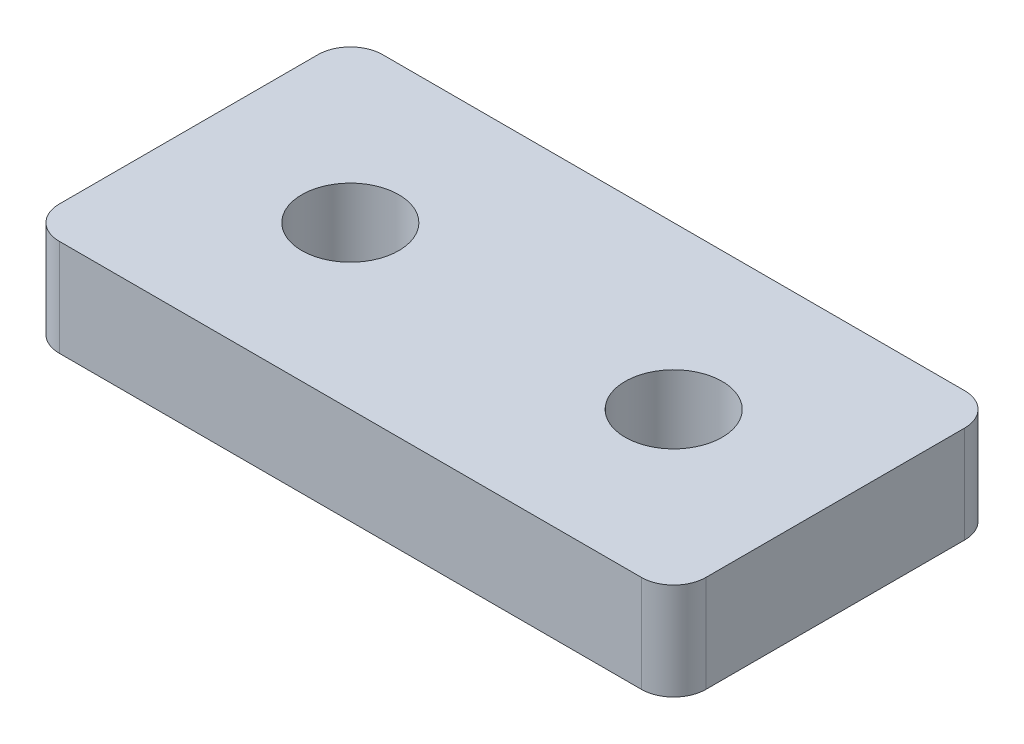
ISO-10303-21;
HEADER;
FILE_DESCRIPTION(('STEP AP214'),'2;1');
FILE_NAME('part.step','',(''),(''),'','','');
FILE_SCHEMA(('AUTOMOTIVE_DESIGN { 1 0 10303 214 1 1 1 1 }'));
ENDSEC;
DATA;
#1=APPLICATION_CONTEXT('core data for automotive mechanical design processes');
#2=APPLICATION_PROTOCOL_DEFINITION('international standard','automotive_design',2000,#1);
#3=PRODUCT_CONTEXT('',#1,'mechanical');
#4=PRODUCT('Part','Part','',(#3));
#5=PRODUCT_RELATED_PRODUCT_CATEGORY('part','',(#4));
#6=PRODUCT_DEFINITION_FORMATION('','',#4);
#7=PRODUCT_DEFINITION_CONTEXT('part definition',#1,'design');
#8=PRODUCT_DEFINITION('design','',#6,#7);
#9=PRODUCT_DEFINITION_SHAPE('','',#8);
#10=(LENGTH_UNIT() NAMED_UNIT(*) SI_UNIT(.MILLI.,.METRE.));
#11=(NAMED_UNIT(*) PLANE_ANGLE_UNIT() SI_UNIT($,.RADIAN.));
#12=(NAMED_UNIT(*) SI_UNIT($,.STERADIAN.) SOLID_ANGLE_UNIT());
#13=UNCERTAINTY_MEASURE_WITH_UNIT(LENGTH_MEASURE(1.E-05),#10,'distance_accuracy_value','');
#14=(GEOMETRIC_REPRESENTATION_CONTEXT(3) GLOBAL_UNCERTAINTY_ASSIGNED_CONTEXT((#13)) GLOBAL_UNIT_ASSIGNED_CONTEXT((#10,
#11,#12)) REPRESENTATION_CONTEXT('',''));
#15=CARTESIAN_POINT('',(0.,0.,0.));
#16=DIRECTION('',(0.,0.,1.));
#17=DIRECTION('',(1.,0.,0.));
#18=AXIS2_PLACEMENT_3D('',#15,#16,#17);
#19=CARTESIAN_POINT('',(0.,3.,0.));
#20=DIRECTION('',(0.,-1.,0.));
#21=DIRECTION('',(0.,0.,-1.));
#22=AXIS2_PLACEMENT_3D('',#19,#20,#21);
#23=PLANE('',#22);
#24=DIRECTION('',(-1.,0.,0.));
#25=VECTOR('',#24,1.);
#26=CARTESIAN_POINT('',(0.,3.,-10.));
#27=LINE('',#26,#25);
#28=CARTESIAN_POINT('',(19.,3.,-10.));
#29=VERTEX_POINT('',#28);
#30=CARTESIAN_POINT('',(1.,3.,-10.));
#31=VERTEX_POINT('',#30);
#32=EDGE_CURVE('E140',#29,#31,#27,.T.);
#33=ORIENTED_EDGE('',*,*,#32,.T.);
#34=CARTESIAN_POINT('',(1.,3.,-9.));
#35=DIRECTION('',(0.,-1.,0.));
#36=DIRECTION('',(0.,0.,-1.));
#37=AXIS2_PLACEMENT_3D('',#34,#35,#36);
#38=CIRCLE('',#37,1.);
#39=CARTESIAN_POINT('',(0.,3.,-9.));
#40=VERTEX_POINT('',#39);
#41=EDGE_CURVE('E159',#31,#40,#38,.F.);
#42=ORIENTED_EDGE('',*,*,#41,.T.);
#43=DIRECTION('',(0.,0.,1.));
#44=VECTOR('',#43,1.);
#45=CARTESIAN_POINT('',(0.,3.,0.));
#46=LINE('',#45,#44);
#47=CARTESIAN_POINT('',(0.,3.,-1.));
#48=VERTEX_POINT('',#47);
#49=EDGE_CURVE('E123',#40,#48,#46,.T.);
#50=ORIENTED_EDGE('',*,*,#49,.T.);
#51=CARTESIAN_POINT('',(1.,3.,-1.));
#52=DIRECTION('',(0.,-1.,0.));
#53=DIRECTION('',(0.,0.,-1.));
#54=AXIS2_PLACEMENT_3D('',#51,#52,#53);
#55=CIRCLE('',#54,1.);
#56=CARTESIAN_POINT('',(1.,3.,0.));
#57=VERTEX_POINT('',#56);
#58=EDGE_CURVE('E157',#48,#57,#55,.F.);
#59=ORIENTED_EDGE('',*,*,#58,.T.);
#60=DIRECTION('',(1.,0.,0.));
#61=VECTOR('',#60,1.);
#62=CARTESIAN_POINT('',(0.,3.,0.));
#63=LINE('',#62,#61);
#64=CARTESIAN_POINT('',(19.,3.,0.));
#65=VERTEX_POINT('',#64);
#66=EDGE_CURVE('E179',#57,#65,#63,.T.);
#67=ORIENTED_EDGE('',*,*,#66,.T.);
#68=CARTESIAN_POINT('',(19.,3.,-1.));
#69=DIRECTION('',(0.,-1.,0.));
#70=DIRECTION('',(0.,0.,-1.));
#71=AXIS2_PLACEMENT_3D('',#68,#69,#70);
#72=CIRCLE('',#71,1.);
#73=CARTESIAN_POINT('',(20.,3.,-1.));
#74=VERTEX_POINT('',#73);
#75=EDGE_CURVE('E58',#65,#74,#72,.F.);
#76=ORIENTED_EDGE('',*,*,#75,.T.);
#77=DIRECTION('',(0.,0.,-1.));
#78=VECTOR('',#77,1.);
#79=CARTESIAN_POINT('',(20.,3.,0.));
#80=LINE('',#79,#78);
#81=CARTESIAN_POINT('',(20.,3.,-9.));
#82=VERTEX_POINT('',#81);
#83=EDGE_CURVE('E169',#74,#82,#80,.T.);
#84=ORIENTED_EDGE('',*,*,#83,.T.);
#85=CARTESIAN_POINT('',(19.,3.,-9.));
#86=DIRECTION('',(0.,-1.,0.));
#87=DIRECTION('',(0.,0.,-1.));
#88=AXIS2_PLACEMENT_3D('',#85,#86,#87);
#89=CIRCLE('',#88,1.);
#90=EDGE_CURVE('E155',#82,#29,#89,.F.);
#91=ORIENTED_EDGE('',*,*,#90,.T.);
#92=EDGE_LOOP('',(#33,#42,#50,#59,#67,#76,#84,#91));
#93=FACE_BOUND('',#92,.T.);
#94=CARTESIAN_POINT('',(5.,3.,-5.));
#95=DIRECTION('',(0.,1.,0.));
#96=DIRECTION('',(0.,0.,1.));
#97=AXIS2_PLACEMENT_3D('',#94,#95,#96);
#98=CIRCLE('',#97,1.5);
#99=CARTESIAN_POINT('',(5.,3.,-3.5));
#100=VERTEX_POINT('',#99);
#101=EDGE_CURVE('E131',#100,#100,#98,.T.);
#102=ORIENTED_EDGE('',*,*,#101,.F.);
#103=EDGE_LOOP('',(#102));
#104=FACE_BOUND('',#103,.T.);
#105=CARTESIAN_POINT('',(15.,3.,-5.));
#106=DIRECTION('',(0.,1.,0.));
#107=DIRECTION('',(0.,0.,1.));
#108=AXIS2_PLACEMENT_3D('',#105,#106,#107);
#109=CIRCLE('',#108,1.5);
#110=CARTESIAN_POINT('',(15.,3.,-3.5));
#111=VERTEX_POINT('',#110);
#112=EDGE_CURVE('E184',#111,#111,#109,.T.);
#113=ORIENTED_EDGE('',*,*,#112,.F.);
#114=EDGE_LOOP('',(#113));
#115=FACE_BOUND('',#114,.T.);
#116=ADVANCED_FACE('F38',(#93,#104,#115),#23,.F.);
#117=CARTESIAN_POINT('',(0.,0.,0.));
#118=DIRECTION('',(0.,-1.,0.));
#119=DIRECTION('',(0.,0.,-1.));
#120=AXIS2_PLACEMENT_3D('',#117,#118,#119);
#121=PLANE('',#120);
#122=CARTESIAN_POINT('',(5.,0.,-5.));
#123=DIRECTION('',(0.,1.,0.));
#124=DIRECTION('',(0.,0.,1.));
#125=AXIS2_PLACEMENT_3D('',#122,#123,#124);
#126=CIRCLE('',#125,1.5);
#127=CARTESIAN_POINT('',(5.,0.,-3.5));
#128=VERTEX_POINT('',#127);
#129=EDGE_CURVE('E137',#128,#128,#126,.T.);
#130=ORIENTED_EDGE('',*,*,#129,.T.);
#131=EDGE_LOOP('',(#130));
#132=FACE_BOUND('',#131,.T.);
#133=DIRECTION('',(0.,0.,1.));
#134=VECTOR('',#133,1.);
#135=CARTESIAN_POINT('',(0.,0.,0.));
#136=LINE('',#135,#134);
#137=CARTESIAN_POINT('',(0.,0.,-9.));
#138=VERTEX_POINT('',#137);
#139=CARTESIAN_POINT('',(0.,0.,-1.));
#140=VERTEX_POINT('',#139);
#141=EDGE_CURVE('E120',#138,#140,#136,.T.);
#142=ORIENTED_EDGE('',*,*,#141,.F.);
#143=CARTESIAN_POINT('',(1.,0.,-9.));
#144=DIRECTION('',(0.,-1.,0.));
#145=DIRECTION('',(0.,0.,-1.));
#146=AXIS2_PLACEMENT_3D('',#143,#144,#145);
#147=CIRCLE('',#146,1.);
#148=CARTESIAN_POINT('',(1.,0.,-10.));
#149=VERTEX_POINT('',#148);
#150=EDGE_CURVE('E103',#138,#149,#147,.T.);
#151=ORIENTED_EDGE('',*,*,#150,.T.);
#152=DIRECTION('',(-1.,0.,0.));
#153=VECTOR('',#152,1.);
#154=CARTESIAN_POINT('',(0.,0.,-10.));
#155=LINE('',#154,#153);
#156=CARTESIAN_POINT('',(19.,0.,-10.));
#157=VERTEX_POINT('',#156);
#158=EDGE_CURVE('E144',#157,#149,#155,.T.);
#159=ORIENTED_EDGE('',*,*,#158,.F.);
#160=CARTESIAN_POINT('',(19.,0.,-9.));
#161=DIRECTION('',(0.,-1.,0.));
#162=DIRECTION('',(0.,0.,-1.));
#163=AXIS2_PLACEMENT_3D('',#160,#161,#162);
#164=CIRCLE('',#163,1.);
#165=CARTESIAN_POINT('',(20.,0.,-9.));
#166=VERTEX_POINT('',#165);
#167=EDGE_CURVE('E148',#157,#166,#164,.T.);
#168=ORIENTED_EDGE('',*,*,#167,.T.);
#169=DIRECTION('',(0.,0.,-1.));
#170=VECTOR('',#169,1.);
#171=CARTESIAN_POINT('',(20.,0.,0.));
#172=LINE('',#171,#170);
#173=CARTESIAN_POINT('',(20.,0.,-1.));
#174=VERTEX_POINT('',#173);
#175=EDGE_CURVE('E134',#174,#166,#172,.T.);
#176=ORIENTED_EDGE('',*,*,#175,.F.);
#177=CARTESIAN_POINT('',(19.,0.,-1.));
#178=DIRECTION('',(0.,-1.,0.));
#179=DIRECTION('',(0.,0.,-1.));
#180=AXIS2_PLACEMENT_3D('',#177,#178,#179);
#181=CIRCLE('',#180,1.);
#182=CARTESIAN_POINT('',(19.,0.,0.));
#183=VERTEX_POINT('',#182);
#184=EDGE_CURVE('E124',#174,#183,#181,.T.);
#185=ORIENTED_EDGE('',*,*,#184,.T.);
#186=DIRECTION('',(1.,0.,0.));
#187=VECTOR('',#186,1.);
#188=CARTESIAN_POINT('',(0.,0.,0.));
#189=LINE('',#188,#187);
#190=CARTESIAN_POINT('',(1.,0.,0.));
#191=VERTEX_POINT('',#190);
#192=EDGE_CURVE('E130',#191,#183,#189,.T.);
#193=ORIENTED_EDGE('',*,*,#192,.F.);
#194=CARTESIAN_POINT('',(1.,0.,-1.));
#195=DIRECTION('',(0.,-1.,0.));
#196=DIRECTION('',(0.,0.,-1.));
#197=AXIS2_PLACEMENT_3D('',#194,#195,#196);
#198=CIRCLE('',#197,1.);
#199=EDGE_CURVE('E114',#191,#140,#198,.T.);
#200=ORIENTED_EDGE('',*,*,#199,.T.);
#201=EDGE_LOOP('',(#142,#151,#159,#168,#176,#185,#193,#200));
#202=FACE_BOUND('',#201,.T.);
#203=CARTESIAN_POINT('',(15.,0.,-5.));
#204=DIRECTION('',(0.,1.,0.));
#205=DIRECTION('',(0.,0.,1.));
#206=AXIS2_PLACEMENT_3D('',#203,#204,#205);
#207=CIRCLE('',#206,1.5);
#208=CARTESIAN_POINT('',(15.,0.,-3.5));
#209=VERTEX_POINT('',#208);
#210=EDGE_CURVE('E186',#209,#209,#207,.T.);
#211=ORIENTED_EDGE('',*,*,#210,.T.);
#212=EDGE_LOOP('',(#211));
#213=FACE_BOUND('',#212,.T.);
#214=ADVANCED_FACE('F127',(#132,#202,#213),#121,.T.);
#215=CARTESIAN_POINT('',(0.,3.,0.));
#216=DIRECTION('',(1.,0.,0.));
#217=DIRECTION('',(0.,0.,-1.));
#218=AXIS2_PLACEMENT_3D('',#215,#216,#217);
#219=PLANE('',#218);
#220=ORIENTED_EDGE('',*,*,#49,.F.);
#221=DIRECTION('',(0.,-1.,0.));
#222=VECTOR('',#221,1.);
#223=CARTESIAN_POINT('',(0.,3.,-9.));
#224=LINE('',#223,#222);
#225=EDGE_CURVE('E107',#40,#138,#224,.T.);
#226=ORIENTED_EDGE('',*,*,#225,.T.);
#227=ORIENTED_EDGE('',*,*,#141,.T.);
#228=DIRECTION('',(0.,-1.,0.));
#229=VECTOR('',#228,1.);
#230=CARTESIAN_POINT('',(0.,3.,-1.));
#231=LINE('',#230,#229);
#232=EDGE_CURVE('E125',#140,#48,#231,.F.);
#233=ORIENTED_EDGE('',*,*,#232,.T.);
#234=EDGE_LOOP('',(#220,#226,#227,#233));
#235=FACE_BOUND('',#234,.T.);
#236=ADVANCED_FACE('F119',(#235),#219,.F.);
#237=CARTESIAN_POINT('',(0.,3.,0.));
#238=DIRECTION('',(0.,0.,-1.));
#239=DIRECTION('',(-1.,0.,0.));
#240=AXIS2_PLACEMENT_3D('',#237,#238,#239);
#241=PLANE('',#240);
#242=ORIENTED_EDGE('',*,*,#66,.F.);
#243=DIRECTION('',(0.,-1.,0.));
#244=VECTOR('',#243,1.);
#245=CARTESIAN_POINT('',(1.,3.,0.));
#246=LINE('',#245,#244);
#247=EDGE_CURVE('E163',#57,#191,#246,.T.);
#248=ORIENTED_EDGE('',*,*,#247,.T.);
#249=ORIENTED_EDGE('',*,*,#192,.T.);
#250=DIRECTION('',(0.,-1.,0.));
#251=VECTOR('',#250,1.);
#252=CARTESIAN_POINT('',(19.,3.,0.));
#253=LINE('',#252,#251);
#254=EDGE_CURVE('E161',#183,#65,#253,.F.);
#255=ORIENTED_EDGE('',*,*,#254,.T.);
#256=EDGE_LOOP('',(#242,#248,#249,#255));
#257=FACE_BOUND('',#256,.T.);
#258=ADVANCED_FACE('F211',(#257),#241,.F.);
#259=CARTESIAN_POINT('',(20.,3.,0.));
#260=DIRECTION('',(-1.,0.,0.));
#261=DIRECTION('',(0.,0.,1.));
#262=AXIS2_PLACEMENT_3D('',#259,#260,#261);
#263=PLANE('',#262);
#264=ORIENTED_EDGE('',*,*,#175,.T.);
#265=DIRECTION('',(0.,-1.,0.));
#266=VECTOR('',#265,1.);
#267=CARTESIAN_POINT('',(20.,3.,-9.));
#268=LINE('',#267,#266);
#269=EDGE_CURVE('E11',#166,#82,#268,.F.);
#270=ORIENTED_EDGE('',*,*,#269,.T.);
#271=ORIENTED_EDGE('',*,*,#83,.F.);
#272=DIRECTION('',(0.,-1.,0.));
#273=VECTOR('',#272,1.);
#274=CARTESIAN_POINT('',(20.,3.,-1.));
#275=LINE('',#274,#273);
#276=EDGE_CURVE('E46',#74,#174,#275,.T.);
#277=ORIENTED_EDGE('',*,*,#276,.T.);
#278=EDGE_LOOP('',(#264,#270,#271,#277));
#279=FACE_BOUND('',#278,.T.);
#280=ADVANCED_FACE('F168',(#279),#263,.F.);
#281=CARTESIAN_POINT('',(0.,3.,-10.));
#282=DIRECTION('',(0.,0.,1.));
#283=DIRECTION('',(1.,0.,0.));
#284=AXIS2_PLACEMENT_3D('',#281,#282,#283);
#285=PLANE('',#284);
#286=ORIENTED_EDGE('',*,*,#158,.T.);
#287=DIRECTION('',(0.,-1.,0.));
#288=VECTOR('',#287,1.);
#289=CARTESIAN_POINT('',(1.,3.,-10.));
#290=LINE('',#289,#288);
#291=EDGE_CURVE('E108',#149,#31,#290,.F.);
#292=ORIENTED_EDGE('',*,*,#291,.T.);
#293=ORIENTED_EDGE('',*,*,#32,.F.);
#294=DIRECTION('',(0.,-1.,0.));
#295=VECTOR('',#294,1.);
#296=CARTESIAN_POINT('',(19.,3.,-10.));
#297=LINE('',#296,#295);
#298=EDGE_CURVE('E113',#29,#157,#297,.T.);
#299=ORIENTED_EDGE('',*,*,#298,.T.);
#300=EDGE_LOOP('',(#286,#292,#293,#299));
#301=FACE_BOUND('',#300,.T.);
#302=ADVANCED_FACE('F177',(#301),#285,.F.);
#303=CARTESIAN_POINT('',(5.,3.,-5.));
#304=DIRECTION('',(0.,-1.,0.));
#305=DIRECTION('',(0.,0.,-1.));
#306=AXIS2_PLACEMENT_3D('',#303,#304,#305);
#307=CYLINDRICAL_SURFACE('',#306,1.5);
#308=ORIENTED_EDGE('',*,*,#101,.T.);
#309=EDGE_LOOP('',(#308));
#310=FACE_BOUND('',#309,.T.);
#311=ORIENTED_EDGE('',*,*,#129,.F.);
#312=EDGE_LOOP('',(#311));
#313=FACE_BOUND('',#312,.T.);
#314=ADVANCED_FACE('F204',(#310,#313),#307,.F.);
#315=CARTESIAN_POINT('',(15.,3.,-5.));
#316=DIRECTION('',(0.,-1.,0.));
#317=DIRECTION('',(0.,0.,-1.));
#318=AXIS2_PLACEMENT_3D('',#315,#316,#317);
#319=CYLINDRICAL_SURFACE('',#318,1.5);
#320=ORIENTED_EDGE('',*,*,#112,.T.);
#321=EDGE_LOOP('',(#320));
#322=FACE_BOUND('',#321,.T.);
#323=ORIENTED_EDGE('',*,*,#210,.F.);
#324=EDGE_LOOP('',(#323));
#325=FACE_BOUND('',#324,.T.);
#326=ADVANCED_FACE('F192',(#322,#325),#319,.F.);
#327=CARTESIAN_POINT('',(1.,3.,-9.));
#328=DIRECTION('',(0.,-1.,0.));
#329=DIRECTION('',(0.,0.,-1.));
#330=AXIS2_PLACEMENT_3D('',#327,#328,#329);
#331=CYLINDRICAL_SURFACE('',#330,1.);
#332=ORIENTED_EDGE('',*,*,#41,.F.);
#333=ORIENTED_EDGE('',*,*,#291,.F.);
#334=ORIENTED_EDGE('',*,*,#150,.F.);
#335=ORIENTED_EDGE('',*,*,#225,.F.);
#336=EDGE_LOOP('',(#332,#333,#334,#335));
#337=FACE_BOUND('',#336,.T.);
#338=ADVANCED_FACE('F106',(#337),#331,.T.);
#339=CARTESIAN_POINT('',(1.,3.,-1.));
#340=DIRECTION('',(0.,-1.,0.));
#341=DIRECTION('',(0.,0.,-1.));
#342=AXIS2_PLACEMENT_3D('',#339,#340,#341);
#343=CYLINDRICAL_SURFACE('',#342,1.);
#344=ORIENTED_EDGE('',*,*,#58,.F.);
#345=ORIENTED_EDGE('',*,*,#232,.F.);
#346=ORIENTED_EDGE('',*,*,#199,.F.);
#347=ORIENTED_EDGE('',*,*,#247,.F.);
#348=EDGE_LOOP('',(#344,#345,#346,#347));
#349=FACE_BOUND('',#348,.T.);
#350=ADVANCED_FACE('F219',(#349),#343,.T.);
#351=CARTESIAN_POINT('',(19.,3.,-9.));
#352=DIRECTION('',(0.,-1.,0.));
#353=DIRECTION('',(0.,0.,-1.));
#354=AXIS2_PLACEMENT_3D('',#351,#352,#353);
#355=CYLINDRICAL_SURFACE('',#354,1.);
#356=ORIENTED_EDGE('',*,*,#90,.F.);
#357=ORIENTED_EDGE('',*,*,#269,.F.);
#358=ORIENTED_EDGE('',*,*,#167,.F.);
#359=ORIENTED_EDGE('',*,*,#298,.F.);
#360=EDGE_LOOP('',(#356,#357,#358,#359));
#361=FACE_BOUND('',#360,.T.);
#362=ADVANCED_FACE('F174',(#361),#355,.T.);
#363=CARTESIAN_POINT('',(19.,3.,-1.));
#364=DIRECTION('',(0.,-1.,0.));
#365=DIRECTION('',(0.,0.,-1.));
#366=AXIS2_PLACEMENT_3D('',#363,#364,#365);
#367=CYLINDRICAL_SURFACE('',#366,1.);
#368=ORIENTED_EDGE('',*,*,#75,.F.);
#369=ORIENTED_EDGE('',*,*,#254,.F.);
#370=ORIENTED_EDGE('',*,*,#184,.F.);
#371=ORIENTED_EDGE('',*,*,#276,.F.);
#372=EDGE_LOOP('',(#368,#369,#370,#371));
#373=FACE_BOUND('',#372,.T.);
#374=ADVANCED_FACE('F40',(#373),#367,.T.);
#375=CLOSED_SHELL('',(#116,#214,#236,#258,#280,#302,#314,#326,#338,#350,#362,#374));
#376=MANIFOLD_SOLID_BREP('B2',#375);
#377=ADVANCED_BREP_SHAPE_REPRESENTATION('',(#18,#376),#14);
#378=SHAPE_DEFINITION_REPRESENTATION(#9,#377);
ENDSEC;
END-ISO-10303-21;
